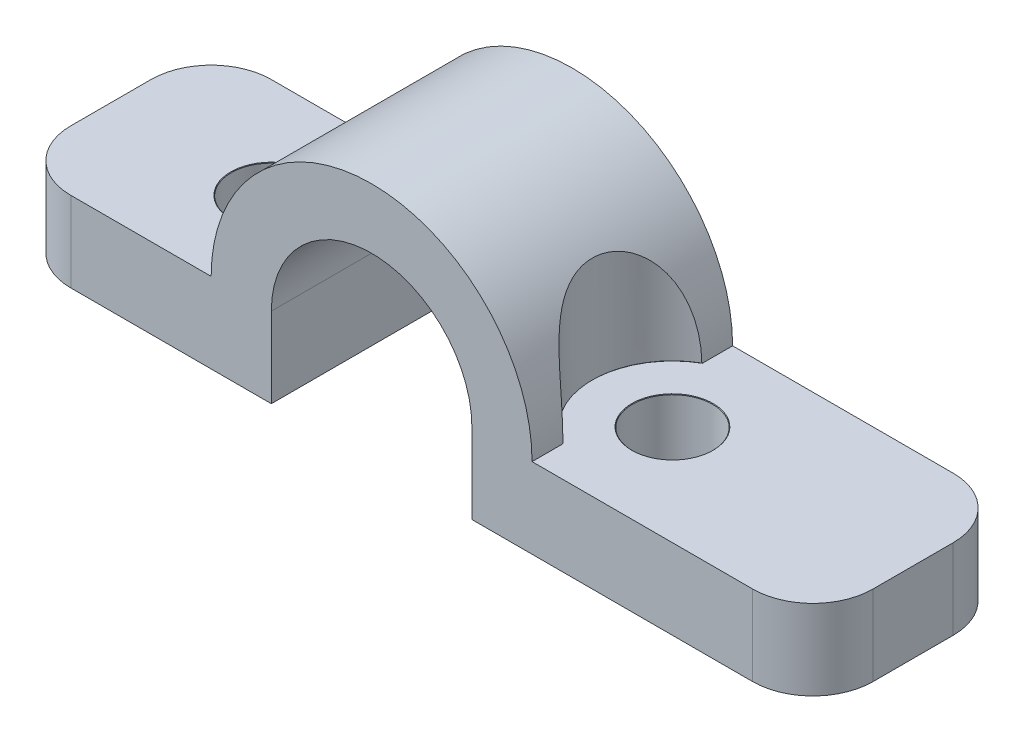
ISO-10303-21;
HEADER;
FILE_DESCRIPTION(('STEP AP214'),'2;1');
FILE_NAME('part.step','',(''),(''),'','','');
FILE_SCHEMA(('AUTOMOTIVE_DESIGN { 1 0 10303 214 1 1 1 1 }'));
ENDSEC;
DATA;
#1=APPLICATION_CONTEXT('core data for automotive mechanical design processes');
#2=APPLICATION_PROTOCOL_DEFINITION('international standard','automotive_design',2000,#1);
#3=PRODUCT_CONTEXT('',#1,'mechanical');
#4=PRODUCT('Part','Part','',(#3));
#5=PRODUCT_RELATED_PRODUCT_CATEGORY('part','',(#4));
#6=PRODUCT_DEFINITION_FORMATION('','',#4);
#7=PRODUCT_DEFINITION_CONTEXT('part definition',#1,'design');
#8=PRODUCT_DEFINITION('design','',#6,#7);
#9=PRODUCT_DEFINITION_SHAPE('','',#8);
#10=(LENGTH_UNIT() NAMED_UNIT(*) SI_UNIT(.MILLI.,.METRE.));
#11=(NAMED_UNIT(*) PLANE_ANGLE_UNIT() SI_UNIT($,.RADIAN.));
#12=(NAMED_UNIT(*) SI_UNIT($,.STERADIAN.) SOLID_ANGLE_UNIT());
#13=UNCERTAINTY_MEASURE_WITH_UNIT(LENGTH_MEASURE(1.E-05),#10,'distance_accuracy_value','');
#14=(GEOMETRIC_REPRESENTATION_CONTEXT(3) GLOBAL_UNCERTAINTY_ASSIGNED_CONTEXT((#13)) GLOBAL_UNIT_ASSIGNED_CONTEXT((#10,
#11,#12)) REPRESENTATION_CONTEXT('',''));
#15=CARTESIAN_POINT('',(0.,0.,0.));
#16=DIRECTION('',(0.,0.,1.));
#17=DIRECTION('',(1.,0.,0.));
#18=AXIS2_PLACEMENT_3D('',#15,#16,#17);
#19=CARTESIAN_POINT('',(-18.,0.,-5.));
#20=DIRECTION('',(-1.,0.,0.));
#21=DIRECTION('',(0.,0.,1.));
#22=AXIS2_PLACEMENT_3D('',#19,#20,#21);
#23=PLANE('',#22);
#24=DIRECTION('',(0.,0.,1.));
#25=VECTOR('',#24,1.);
#26=CARTESIAN_POINT('',(-18.,4.,-5.));
#27=LINE('',#26,#25);
#28=CARTESIAN_POINT('',(-18.,4.,-2.));
#29=VERTEX_POINT('',#28);
#30=CARTESIAN_POINT('',(-18.,4.,2.));
#31=VERTEX_POINT('',#30);
#32=EDGE_CURVE('E184',#29,#31,#27,.T.);
#33=ORIENTED_EDGE('',*,*,#32,.F.);
#34=DIRECTION('',(0.,-1.,0.));
#35=VECTOR('',#34,1.);
#36=CARTESIAN_POINT('',(-18.,0.,-2.));
#37=LINE('',#36,#35);
#38=CARTESIAN_POINT('',(-18.,0.,-2.));
#39=VERTEX_POINT('',#38);
#40=EDGE_CURVE('E233',#29,#39,#37,.T.);
#41=ORIENTED_EDGE('',*,*,#40,.T.);
#42=DIRECTION('',(0.,0.,1.));
#43=VECTOR('',#42,1.);
#44=CARTESIAN_POINT('',(-18.,0.,-5.));
#45=LINE('',#44,#43);
#46=CARTESIAN_POINT('',(-18.,0.,2.));
#47=VERTEX_POINT('',#46);
#48=EDGE_CURVE('E211',#39,#47,#45,.T.);
#49=ORIENTED_EDGE('',*,*,#48,.T.);
#50=DIRECTION('',(0.,-1.,0.));
#51=VECTOR('',#50,1.);
#52=CARTESIAN_POINT('',(-18.,4.,2.));
#53=LINE('',#52,#51);
#54=EDGE_CURVE('E231',#47,#31,#53,.F.);
#55=ORIENTED_EDGE('',*,*,#54,.T.);
#56=EDGE_LOOP('',(#33,#41,#49,#55));
#57=FACE_BOUND('',#56,.T.);
#58=ADVANCED_FACE('F33',(#57),#23,.T.);
#59=CARTESIAN_POINT('',(-18.,4.,-5.));
#60=DIRECTION('',(0.,1.,0.));
#61=DIRECTION('',(0.,0.,1.));
#62=AXIS2_PLACEMENT_3D('',#59,#60,#61);
#63=PLANE('',#62);
#64=DIRECTION('',(0.,0.,1.));
#65=VECTOR('',#64,1.);
#66=CARTESIAN_POINT('',(-8.,4.,-5.));
#67=LINE('',#66,#65);
#68=CARTESIAN_POINT('',(-8.,4.,3.49293930665851));
#69=VERTEX_POINT('',#68);
#70=CARTESIAN_POINT('',(-8.,4.,5.));
#71=VERTEX_POINT('',#70);
#72=EDGE_CURVE('E185',#69,#71,#67,.T.);
#73=ORIENTED_EDGE('',*,*,#72,.F.);
#74=CARTESIAN_POINT('',(-10.,4.,0.));
#75=DIRECTION('',(0.,-1.,0.));
#76=DIRECTION('',(0.,0.,-1.));
#77=AXIS2_PLACEMENT_3D('',#74,#75,#76);
#78=CIRCLE('',#77,4.025);
#79=CARTESIAN_POINT('',(-8.,4.,-3.49293930665851));
#80=VERTEX_POINT('',#79);
#81=EDGE_CURVE('E172',#80,#69,#78,.T.);
#82=ORIENTED_EDGE('',*,*,#81,.F.);
#83=CARTESIAN_POINT('',(-8.,4.,-5.));
#84=VERTEX_POINT('',#83);
#85=EDGE_CURVE('E177',#84,#80,#67,.T.);
#86=ORIENTED_EDGE('',*,*,#85,.F.);
#87=DIRECTION('',(-1.,0.,0.));
#88=VECTOR('',#87,1.);
#89=CARTESIAN_POINT('',(-18.,4.,-5.));
#90=LINE('',#89,#88);
#91=CARTESIAN_POINT('',(-15.,4.,-5.));
#92=VERTEX_POINT('',#91);
#93=EDGE_CURVE('E214',#84,#92,#90,.T.);
#94=ORIENTED_EDGE('',*,*,#93,.T.);
#95=CARTESIAN_POINT('',(-15.,4.,-2.));
#96=DIRECTION('',(0.,1.,0.));
#97=DIRECTION('',(0.,0.,1.));
#98=AXIS2_PLACEMENT_3D('',#95,#96,#97);
#99=CIRCLE('',#98,3.);
#100=EDGE_CURVE('E242',#92,#29,#99,.T.);
#101=ORIENTED_EDGE('',*,*,#100,.T.);
#102=ORIENTED_EDGE('',*,*,#32,.T.);
#103=CARTESIAN_POINT('',(-15.,4.,2.));
#104=DIRECTION('',(0.,1.,0.));
#105=DIRECTION('',(0.,0.,1.));
#106=AXIS2_PLACEMENT_3D('',#103,#104,#105);
#107=CIRCLE('',#106,3.);
#108=CARTESIAN_POINT('',(-15.,4.,5.));
#109=VERTEX_POINT('',#108);
#110=EDGE_CURVE('E240',#31,#109,#107,.T.);
#111=ORIENTED_EDGE('',*,*,#110,.T.);
#112=DIRECTION('',(-1.,0.,0.));
#113=VECTOR('',#112,1.);
#114=CARTESIAN_POINT('',(-18.,4.,5.));
#115=LINE('',#114,#113);
#116=EDGE_CURVE('E348',#71,#109,#115,.T.);
#117=ORIENTED_EDGE('',*,*,#116,.F.);
#118=EDGE_LOOP('',(#73,#82,#86,#94,#101,#102,#111,#117));
#119=FACE_BOUND('',#118,.T.);
#120=CARTESIAN_POINT('',(-10.,4.,0.));
#121=DIRECTION('',(0.,1.,0.));
#122=DIRECTION('',(0.,0.,1.));
#123=AXIS2_PLACEMENT_3D('',#120,#121,#122);
#124=CIRCLE('',#123,2.025);
#125=CARTESIAN_POINT('',(-10.,4.,2.025));
#126=VERTEX_POINT('',#125);
#127=EDGE_CURVE('E313',#126,#126,#124,.T.);
#128=ORIENTED_EDGE('',*,*,#127,.F.);
#129=EDGE_LOOP('',(#128));
#130=FACE_BOUND('',#129,.T.);
#131=ADVANCED_FACE('F299',(#119,#130),#63,.T.);
#132=CARTESIAN_POINT('',(0.,4.,-5.));
#133=DIRECTION('',(0.,0.,1.));
#134=DIRECTION('',(1.,0.,0.));
#135=AXIS2_PLACEMENT_3D('',#132,#133,#134);
#136=CYLINDRICAL_SURFACE('',#135,8.);
#137=CARTESIAN_POINT('',(-7.99995204423127,4.0277,-3.46095585996489));
#138=CARTESIAN_POINT('',(-7.99996957764709,4.02263972398067,-3.46681040292332));
#139=CARTESIAN_POINT('',(-7.9999823027003,4.01757625263604,-3.47266218446504));
#140=CARTESIAN_POINT('',(-7.99999813608153,4.0074429193027,-3.48436022470756));
#141=CARTESIAN_POINT('',(-8.00000124440955,4.002373057314,-3.49020648340836));
#142=CARTESIAN_POINT('',(-7.99999954437499,3.9973,-3.49604998069246));
#143=B_SPLINE_CURVE_WITH_KNOTS('',3,(#137,#138,#139,#140,#141,#142),.UNSPECIFIED.,.F.,.F.,(4,2,
4),(0.,0.0232150869214942,0.0464301738131203),.UNSPECIFIED.);
#144=CARTESIAN_POINT('',(-7.99996093740463,4.025,-3.46407906204414));
#145=VERTEX_POINT('',#144);
#146=EDGE_CURVE('E11',#145,#80,#143,.T.);
#147=ORIENTED_EDGE('',*,*,#146,.F.);
#148=CARTESIAN_POINT('',(-7.99996093740463,4.025,3.46407906204414));
#149=CARTESIAN_POINT('',(-7.99969797190053,4.10923273656466,3.46392402297538));
#150=CARTESIAN_POINT('',(-7.99810393301854,4.19345225549861,3.46300729437637));
#151=CARTESIAN_POINT('',(-7.99225973584734,4.36176818488701,3.45962345500483));
#152=CARTESIAN_POINT('',(-7.98800956621208,4.44586459481404,3.4571563376096));
#153=CARTESIAN_POINT('',(-7.97127865709272,4.69790239293734,3.44738583375854));
#154=CARTESIAN_POINT('',(-7.95481777597678,4.86551261003954,3.43771339036424));
#155=CARTESIAN_POINT('',(-7.91128390373772,5.20011545013118,3.41143872365164));
#156=CARTESIAN_POINT('',(-7.88412995309651,5.36709331132888,3.39478356902883));
#157=CARTESIAN_POINT('',(-7.81952958510747,5.6980456938918,3.35365763147336));
#158=CARTESIAN_POINT('',(-7.78208614910302,5.86202107055984,3.32918911210435));
#159=CARTESIAN_POINT('',(-7.70395012665325,6.16083146605703,3.27567250529183));
#160=CARTESIAN_POINT('',(-7.66464827765331,6.29626184661323,3.24791190075164));
#161=CARTESIAN_POINT('',(-7.57952197492005,6.56329300080081,3.18497885016741));
#162=CARTESIAN_POINT('',(-7.5336986945703,6.6948944582406,3.14980773693043));
#163=CARTESIAN_POINT('',(-7.43633574554271,6.95294309436941,3.07108018201846));
#164=CARTESIAN_POINT('',(-7.38481289479551,7.079404007192,3.02754814541693));
#165=CARTESIAN_POINT('',(-7.27688566168496,7.32642111165351,2.93085245385272));
#166=CARTESIAN_POINT('',(-7.22048292779599,7.44697927591751,2.87769204486857));
#167=CARTESIAN_POINT('',(-7.11952336573038,7.6498795922888,2.77606378824973));
#168=CARTESIAN_POINT('',(-7.0757885423064,7.73388238104164,2.73008597601526));
#169=CARTESIAN_POINT('',(-6.98705213019283,7.89740271542049,2.6318296444419));
#170=CARTESIAN_POINT('',(-6.94205087388019,7.97692142174296,2.57955276669662));
#171=CARTESIAN_POINT('',(-6.85160074328792,8.13080175272035,2.46834182019133));
#172=CARTESIAN_POINT('',(-6.806152243454,8.2051673313425,2.40941294883268));
#173=CARTESIAN_POINT('',(-6.71573154801604,8.34811617418772,2.28462693053741));
#174=CARTESIAN_POINT('',(-6.67075926790155,8.4167004799241,2.21877103635026));
#175=CARTESIAN_POINT('',(-6.55404453202282,8.58924509579359,2.03557558211148));
#176=CARTESIAN_POINT('',(-6.48355338788034,8.68781591827526,1.91222226721444));
#177=CARTESIAN_POINT('',(-6.35190083649897,8.86472902204808,1.64717148616044));
#178=CARTESIAN_POINT('',(-6.290737064551,8.94307643395181,1.50547868639329));
#179=CARTESIAN_POINT('',(-6.2098268338169,9.04380075002214,1.2810210709257));
#180=CARTESIAN_POINT('',(-6.18459162193383,9.07465643819709,1.20391619180751));
#181=CARTESIAN_POINT('',(-6.13841250644518,9.1304192232599,1.0463581026631));
#182=CARTESIAN_POINT('',(-6.11746667227406,9.15532899712796,0.965906418672271));
#183=CARTESIAN_POINT('',(-6.08038346675806,9.19901559754903,0.802272742830093));
#184=CARTESIAN_POINT('',(-6.0642459179524,9.21779265044659,0.719090851869098));
#185=CARTESIAN_POINT('',(-6.0371789036451,9.2490845004237,0.550755653708957));
#186=CARTESIAN_POINT('',(-6.02624887958688,9.26159996912495,0.465602558967991));
#187=CARTESIAN_POINT('',(-6.00347927501828,9.28760876407288,0.226678983541391));
#188=CARTESIAN_POINT('',(-5.99765005550933,9.29416999243719,0.0714733268267729));
#189=CARTESIAN_POINT('',(-6.00408234722193,9.28687057064538,-0.237952806926167));
#190=CARTESIAN_POINT('',(-6.01633770741371,9.27301686413483,-0.392173601025394));
#191=CARTESIAN_POINT('',(-6.05712826259199,9.22609845765382,-0.689533061463698));
#192=CARTESIAN_POINT('',(-6.08505165013523,9.19375490652794,-0.832870750999783));
#193=CARTESIAN_POINT('',(-6.15463321227106,9.11110387310646,-1.11071072804406));
#194=CARTESIAN_POINT('',(-6.19629159583091,9.06079611749855,-1.24521288108912));
#195=CARTESIAN_POINT('',(-6.29222324735269,8.94105389671474,-1.5075348793511));
#196=CARTESIAN_POINT('',(-6.34692487710921,8.87095042398395,-1.63489000659682));
#197=CARTESIAN_POINT('',(-6.46415637206808,8.71425678293628,-1.87501700311941));
#198=CARTESIAN_POINT('',(-6.52668955033236,8.62765962900182,-1.9877826591687));
#199=CARTESIAN_POINT('',(-6.6352982164937,8.46977661712481,-2.16469691543467));
#200=CARTESIAN_POINT('',(-6.68033571983273,8.40228989462644,-2.2329537712367));
#201=CARTESIAN_POINT('',(-6.77116619946717,8.26125996162167,-2.3623887499653));
#202=CARTESIAN_POINT('',(-6.81695938936908,8.18771501437556,-2.42356483083968));
#203=CARTESIAN_POINT('',(-6.90833458588499,8.03519841737819,-2.53910222629693));
#204=CARTESIAN_POINT('',(-6.95391629442826,7.95622071331698,-2.59345574086843));
#205=CARTESIAN_POINT('',(-7.04397631952828,7.79355363000803,-2.69565637061808));
#206=CARTESIAN_POINT('',(-7.08845432432109,7.70986294082304,-2.74350166414058));
#207=CARTESIAN_POINT('',(-7.19110206769607,7.5078533832993,-2.84908494666468));
#208=CARTESIAN_POINT('',(-7.24850891702842,7.38781375915425,-2.90428076931744));
#209=CARTESIAN_POINT('',(-7.35858572951996,7.1415649251134,-3.00474384165666));
#210=CARTESIAN_POINT('',(-7.41125400393055,7.01535354024541,-3.05000755991201));
#211=CARTESIAN_POINT('',(-7.51099117761329,6.75756590453358,-3.13193437153713));
#212=CARTESIAN_POINT('',(-7.55804267360964,6.62597459293233,-3.16857105899075));
#213=CARTESIAN_POINT('',(-7.64564872760647,6.35877893980923,-3.23419582922868));
#214=CARTESIAN_POINT('',(-7.68620198801016,6.22317380317753,-3.26318238514629));
#215=CARTESIAN_POINT('',(-7.76823931244062,5.9194299059439,-3.31997746675532));
#216=CARTESIAN_POINT('',(-7.80806187400318,5.75054458748658,-3.3462035170474));
#217=CARTESIAN_POINT('',(-7.87678428948145,5.40945554657865,-3.39022338203617));
#218=CARTESIAN_POINT('',(-7.90568035629818,5.23725069527958,-3.40801427366687));
#219=CARTESIAN_POINT('',(-7.95199034661905,4.89213467968135,-3.43604212606164));
#220=CARTESIAN_POINT('',(-7.96949661456746,4.71924092915406,-3.44633992109434));
#221=CARTESIAN_POINT('',(-7.9872814073239,4.4592229323598,-3.45673312373376));
#222=CARTESIAN_POINT('',(-7.9917971565954,4.37246200986037,-3.45935524850705));
#223=CARTESIAN_POINT('',(-7.99800126074643,4.1988055043459,-3.46294807240828));
#224=CARTESIAN_POINT('',(-7.99968963532629,4.11190992227335,-3.46391878304281));
#225=CARTESIAN_POINT('',(-7.99996093740463,4.025,-3.46407906204414));
#226=B_SPLINE_CURVE_WITH_KNOTS('',3,(#148,#149,#150,#151,#152,#153,#154,#155,#156,#157,#158,
#159,#160,#161,#162,#163,#164,#165,#166,#167,#168,#169,#170,#171,#172,#173,#174,#175,#176,#177,
#178,#179,#180,#181,#182,#183,#184,#185,#186,#187,#188,#189,#190,#191,#192,#193,#194,#195,#196,
#197,#198,#199,#200,#201,#202,#203,#204,#205,#206,#207,#208,#209,#210,#211,#212,#213,#214,#215,
#216,#217,#218,#219,#220,#221,#222,#223,#224,#225),.UNSPECIFIED.,.F.,.F.,(4,2,2,2,2,2,2,2,2,2,2,
2,2,2,2,2,2,2,2,2,2,2,2,2,2,2,2,2,2,2,2,2,2,2,2,2,2,2,4),(0.,0.252670358861786,
0.505341797047868,1.01092331525207,1.52040865840866,2.02974653528816,2.46056510148885,
2.89130624943759,3.32080868840061,3.75016659936097,4.06573781788458,4.38122697284042,
4.69647131096297,5.01165873497163,5.52819267741862,6.04459544782612,6.30467581107584,
6.56463885868272,6.82459231057009,7.08451787369639,7.54830912032308,8.01194265599734,
8.45861938583828,8.90530291183056,9.36939487294943,9.83368383116002,10.1513722692221,
10.4691520995996,10.7872919905257,11.1055207465999,11.5370421627116,11.9687167616378,
12.4016959521035,12.8347614943406,13.3605957467191,13.8866120853985,14.4083086944775,
14.6690095487375,14.9297085865),.UNSPECIFIED.);
#227=CARTESIAN_POINT('',(-7.99996093740463,4.025,3.46407906204414));
#228=VERTEX_POINT('',#227);
#229=EDGE_CURVE('E161',#228,#145,#226,.T.);
#230=ORIENTED_EDGE('',*,*,#229,.F.);
#231=CARTESIAN_POINT('',(-7.99999954437499,3.9973,3.49604998069246));
#232=CARTESIAN_POINT('',(-8.00000124440955,4.00237305731399,3.49020648340836));
#233=CARTESIAN_POINT('',(-7.99999813608153,4.0074429193027,3.48436022470756));
#234=CARTESIAN_POINT('',(-7.9999823027003,4.01757625263604,3.47266218446504));
#235=CARTESIAN_POINT('',(-7.99996957764709,4.02263972398067,3.46681040292332));
#236=CARTESIAN_POINT('',(-7.99995204423127,4.0277,3.46095585996489));
#237=B_SPLINE_CURVE_WITH_KNOTS('',3,(#231,#232,#233,#234,#235,#236),.UNSPECIFIED.,.F.,.F.,(4,2,
4),(0.,0.0232150868916257,0.0464301738131208),.UNSPECIFIED.);
#238=EDGE_CURVE('E47',#69,#228,#237,.T.);
#239=ORIENTED_EDGE('',*,*,#238,.F.);
#240=ORIENTED_EDGE('',*,*,#72,.T.);
#241=CARTESIAN_POINT('',(0.,4.,5.));
#242=DIRECTION('',(0.,0.,1.));
#243=DIRECTION('',(-1.,0.,0.));
#244=AXIS2_PLACEMENT_3D('',#241,#242,#243);
#245=CIRCLE('',#244,8.);
#246=CARTESIAN_POINT('',(8.,4.,5.));
#247=VERTEX_POINT('',#246);
#248=EDGE_CURVE('E345',#247,#71,#245,.T.);
#249=ORIENTED_EDGE('',*,*,#248,.F.);
#250=DIRECTION('',(0.,0.,1.));
#251=VECTOR('',#250,1.);
#252=CARTESIAN_POINT('',(8.,4.,-5.));
#253=LINE('',#252,#251);
#254=CARTESIAN_POINT('',(8.,4.,3.49293930665851));
#255=VERTEX_POINT('',#254);
#256=EDGE_CURVE('E195',#255,#247,#253,.T.);
#257=ORIENTED_EDGE('',*,*,#256,.F.);
#258=CARTESIAN_POINT('',(7.99995204423127,4.0277,3.46095585996489));
#259=CARTESIAN_POINT('',(7.99996957764709,4.02263972398067,3.46681040292332));
#260=CARTESIAN_POINT('',(7.9999823027003,4.01757625263604,3.47266218446504));
#261=CARTESIAN_POINT('',(7.99999813608153,4.0074429193027,3.48436022470756));
#262=CARTESIAN_POINT('',(8.00000124440955,4.002373057314,3.49020648340836));
#263=CARTESIAN_POINT('',(7.99999954437499,3.9973,3.49604998069246));
#264=B_SPLINE_CURVE_WITH_KNOTS('',3,(#258,#259,#260,#261,#262,#263),.UNSPECIFIED.,.F.,.F.,(4,2,
4),(0.,0.0232150869214949,0.046430173813121),.UNSPECIFIED.);
#265=CARTESIAN_POINT('',(7.99996093740463,4.025,3.46407906204414));
#266=VERTEX_POINT('',#265);
#267=EDGE_CURVE('E166',#266,#255,#264,.T.);
#268=ORIENTED_EDGE('',*,*,#267,.F.);
#269=CARTESIAN_POINT('',(7.99996093740463,4.025,-3.46407906204414));
#270=CARTESIAN_POINT('',(7.99969797190053,4.10923273656466,-3.46392402297538));
#271=CARTESIAN_POINT('',(7.99810393301854,4.19345225549861,-3.46300729437637));
#272=CARTESIAN_POINT('',(7.99225973584734,4.36176818488701,-3.45962345500483));
#273=CARTESIAN_POINT('',(7.98800956621208,4.44586459481404,-3.4571563376096));
#274=CARTESIAN_POINT('',(7.97127865709272,4.69790239293734,-3.44738583375854));
#275=CARTESIAN_POINT('',(7.95481777597678,4.86551261003954,-3.43771339036424));
#276=CARTESIAN_POINT('',(7.91128390373772,5.20011545013118,-3.41143872365164));
#277=CARTESIAN_POINT('',(7.88412995309651,5.36709331132888,-3.39478356902883));
#278=CARTESIAN_POINT('',(7.81952958510747,5.6980456938918,-3.35365763147336));
#279=CARTESIAN_POINT('',(7.78208614910302,5.86202107055984,-3.32918911210435));
#280=CARTESIAN_POINT('',(7.70395012665325,6.16083146605703,-3.27567250529183));
#281=CARTESIAN_POINT('',(7.66464827765331,6.29626184661323,-3.24791190075164));
#282=CARTESIAN_POINT('',(7.57952197492005,6.56329300080081,-3.18497885016741));
#283=CARTESIAN_POINT('',(7.5336986945703,6.6948944582406,-3.14980773693043));
#284=CARTESIAN_POINT('',(7.43633574554271,6.95294309436941,-3.07108018201846));
#285=CARTESIAN_POINT('',(7.38481289479551,7.079404007192,-3.02754814541693));
#286=CARTESIAN_POINT('',(7.27688566168496,7.32642111165351,-2.93085245385272));
#287=CARTESIAN_POINT('',(7.22048292779599,7.44697927591751,-2.87769204486857));
#288=CARTESIAN_POINT('',(7.11952336573038,7.6498795922888,-2.77606378824973));
#289=CARTESIAN_POINT('',(7.0757885423064,7.73388238104164,-2.73008597601526));
#290=CARTESIAN_POINT('',(6.98705213019283,7.89740271542049,-2.6318296444419));
#291=CARTESIAN_POINT('',(6.94205087388019,7.97692142174296,-2.57955276669662));
#292=CARTESIAN_POINT('',(6.85160074328792,8.13080175272035,-2.46834182019133));
#293=CARTESIAN_POINT('',(6.806152243454,8.2051673313425,-2.40941294883268));
#294=CARTESIAN_POINT('',(6.71573154801604,8.34811617418772,-2.28462693053741));
#295=CARTESIAN_POINT('',(6.67075926790155,8.4167004799241,-2.21877103635026));
#296=CARTESIAN_POINT('',(6.55404453202282,8.58924509579359,-2.03557558211148));
#297=CARTESIAN_POINT('',(6.48355338788034,8.68781591827526,-1.91222226721444));
#298=CARTESIAN_POINT('',(6.35190083649897,8.86472902204808,-1.64717148616044));
#299=CARTESIAN_POINT('',(6.290737064551,8.94307643395181,-1.50547868639329));
#300=CARTESIAN_POINT('',(6.2098268338169,9.04380075002214,-1.2810210709257));
#301=CARTESIAN_POINT('',(6.18459162193383,9.07465643819709,-1.20391619180751));
#302=CARTESIAN_POINT('',(6.13841250644518,9.1304192232599,-1.0463581026631));
#303=CARTESIAN_POINT('',(6.11746667227406,9.15532899712796,-0.965906418672271));
#304=CARTESIAN_POINT('',(6.08038346675806,9.19901559754903,-0.802272742830093));
#305=CARTESIAN_POINT('',(6.0642459179524,9.21779265044659,-0.719090851869098));
#306=CARTESIAN_POINT('',(6.0371789036451,9.2490845004237,-0.550755653708957));
#307=CARTESIAN_POINT('',(6.02624887958688,9.26159996912495,-0.465602558967991));
#308=CARTESIAN_POINT('',(6.00347927501828,9.28760876407288,-0.226678983541391));
#309=CARTESIAN_POINT('',(5.99765005550933,9.29416999243719,-0.0714733268267729));
#310=CARTESIAN_POINT('',(6.00408234722193,9.28687057064538,0.237952806926167));
#311=CARTESIAN_POINT('',(6.01633770741371,9.27301686413483,0.392173601025394));
#312=CARTESIAN_POINT('',(6.05712826259199,9.22609845765382,0.689533061463698));
#313=CARTESIAN_POINT('',(6.08505165013523,9.19375490652794,0.832870750999783));
#314=CARTESIAN_POINT('',(6.15463321227106,9.11110387310646,1.11071072804406));
#315=CARTESIAN_POINT('',(6.19629159583091,9.06079611749855,1.24521288108912));
#316=CARTESIAN_POINT('',(6.29222324735269,8.94105389671474,1.5075348793511));
#317=CARTESIAN_POINT('',(6.34692487710921,8.87095042398395,1.63489000659682));
#318=CARTESIAN_POINT('',(6.46415637206808,8.71425678293628,1.87501700311941));
#319=CARTESIAN_POINT('',(6.52668955033236,8.62765962900182,1.9877826591687));
#320=CARTESIAN_POINT('',(6.6352982164937,8.46977661712481,2.16469691543467));
#321=CARTESIAN_POINT('',(6.68033571983273,8.40228989462644,2.2329537712367));
#322=CARTESIAN_POINT('',(6.77116619946717,8.26125996162167,2.3623887499653));
#323=CARTESIAN_POINT('',(6.81695938936908,8.18771501437556,2.42356483083968));
#324=CARTESIAN_POINT('',(6.90833458588499,8.03519841737819,2.53910222629693));
#325=CARTESIAN_POINT('',(6.95391629442826,7.95622071331698,2.59345574086843));
#326=CARTESIAN_POINT('',(7.04397631952828,7.79355363000803,2.69565637061808));
#327=CARTESIAN_POINT('',(7.08845432432109,7.70986294082304,2.74350166414058));
#328=CARTESIAN_POINT('',(7.19110206769607,7.5078533832993,2.84908494666468));
#329=CARTESIAN_POINT('',(7.24850891702842,7.38781375915425,2.90428076931744));
#330=CARTESIAN_POINT('',(7.35858572951996,7.1415649251134,3.00474384165666));
#331=CARTESIAN_POINT('',(7.41125400393055,7.01535354024541,3.05000755991201));
#332=CARTESIAN_POINT('',(7.51099117761329,6.75756590453358,3.13193437153713));
#333=CARTESIAN_POINT('',(7.55804267360964,6.62597459293233,3.16857105899075));
#334=CARTESIAN_POINT('',(7.64564872760647,6.35877893980923,3.23419582922868));
#335=CARTESIAN_POINT('',(7.68620198801016,6.22317380317753,3.26318238514629));
#336=CARTESIAN_POINT('',(7.76823931244062,5.9194299059439,3.31997746675532));
#337=CARTESIAN_POINT('',(7.80806187400318,5.75054458748658,3.3462035170474));
#338=CARTESIAN_POINT('',(7.87678428948145,5.40945554657865,3.39022338203617));
#339=CARTESIAN_POINT('',(7.90568035629818,5.23725069527958,3.40801427366687));
#340=CARTESIAN_POINT('',(7.95199034661905,4.89213467968135,3.43604212606164));
#341=CARTESIAN_POINT('',(7.96949661456746,4.71924092915406,3.44633992109434));
#342=CARTESIAN_POINT('',(7.9872814073239,4.4592229323598,3.45673312373376));
#343=CARTESIAN_POINT('',(7.9917971565954,4.37246200986037,3.45935524850705));
#344=CARTESIAN_POINT('',(7.99800126074643,4.1988055043459,3.46294807240828));
#345=CARTESIAN_POINT('',(7.99968963532629,4.11190992227335,3.46391878304281));
#346=CARTESIAN_POINT('',(7.99996093740463,4.025,3.46407906204414));
#347=B_SPLINE_CURVE_WITH_KNOTS('',3,(#269,#270,#271,#272,#273,#274,#275,#276,#277,#278,#279,
#280,#281,#282,#283,#284,#285,#286,#287,#288,#289,#290,#291,#292,#293,#294,#295,#296,#297,#298,
#299,#300,#301,#302,#303,#304,#305,#306,#307,#308,#309,#310,#311,#312,#313,#314,#315,#316,#317,
#318,#319,#320,#321,#322,#323,#324,#325,#326,#327,#328,#329,#330,#331,#332,#333,#334,#335,#336,
#337,#338,#339,#340,#341,#342,#343,#344,#345,#346),.UNSPECIFIED.,.F.,.F.,(4,2,2,2,2,2,2,2,2,2,2,
2,2,2,2,2,2,2,2,2,2,2,2,2,2,2,2,2,2,2,2,2,2,2,2,2,2,2,4),(0.,0.252670358861786,
0.505341797047868,1.01092331525207,1.52040865840866,2.02974653528816,2.46056510148885,
2.89130624943759,3.32080868840061,3.75016659936097,4.06573781788458,4.38122697284042,
4.69647131096297,5.01165873497163,5.52819267741862,6.04459544782612,6.30467581107584,
6.56463885868272,6.82459231057009,7.08451787369639,7.54830912032308,8.01194265599734,
8.45861938583828,8.90530291183056,9.36939487294943,9.83368383116002,10.1513722692221,
10.4691520995996,10.7872919905257,11.1055207465999,11.5370421627116,11.9687167616378,
12.4016959521035,12.8347614943406,13.3605957467191,13.8866120853985,14.4083086944775,
14.6690095487375,14.9297085865),.UNSPECIFIED.);
#348=CARTESIAN_POINT('',(7.99996093740463,4.025,-3.46407906204414));
#349=VERTEX_POINT('',#348);
#350=EDGE_CURVE('E250',#349,#266,#347,.T.);
#351=ORIENTED_EDGE('',*,*,#350,.F.);
#352=CARTESIAN_POINT('',(7.99999954437499,3.9973,-3.49604998069246));
#353=CARTESIAN_POINT('',(8.00000124440955,4.00237305731399,-3.49020648340836));
#354=CARTESIAN_POINT('',(7.99999813608153,4.0074429193027,-3.48436022470756));
#355=CARTESIAN_POINT('',(7.9999823027003,4.01757625263604,-3.47266218446504));
#356=CARTESIAN_POINT('',(7.99996957764709,4.02263972398067,-3.46681040292332));
#357=CARTESIAN_POINT('',(7.99995204423127,4.0277,-3.46095585996489));
#358=B_SPLINE_CURVE_WITH_KNOTS('',3,(#352,#353,#354,#355,#356,#357),.UNSPECIFIED.,.F.,.F.,(4,2,
4),(0.,0.023215086891626,0.0464301738131209),.UNSPECIFIED.);
#359=CARTESIAN_POINT('',(8.,4.,-3.49293930665851));
#360=VERTEX_POINT('',#359);
#361=EDGE_CURVE('E257',#360,#349,#358,.T.);
#362=ORIENTED_EDGE('',*,*,#361,.F.);
#363=CARTESIAN_POINT('',(8.,4.,-5.));
#364=VERTEX_POINT('',#363);
#365=EDGE_CURVE('E190',#364,#360,#253,.T.);
#366=ORIENTED_EDGE('',*,*,#365,.F.);
#367=CARTESIAN_POINT('',(0.,4.,-5.));
#368=DIRECTION('',(0.,0.,1.));
#369=DIRECTION('',(-1.,0.,0.));
#370=AXIS2_PLACEMENT_3D('',#367,#368,#369);
#371=CIRCLE('',#370,8.);
#372=EDGE_CURVE('E180',#364,#84,#371,.T.);
#373=ORIENTED_EDGE('',*,*,#372,.T.);
#374=ORIENTED_EDGE('',*,*,#85,.T.);
#375=EDGE_LOOP('',(#147,#230,#239,#240,#249,#257,#268,#351,#362,#366,#373,#374));
#376=FACE_BOUND('',#375,.T.);
#377=ADVANCED_FACE('F175',(#376),#136,.T.);
#378=CARTESIAN_POINT('',(8.,4.,-5.));
#379=DIRECTION('',(0.,1.,0.));
#380=DIRECTION('',(0.,0.,1.));
#381=AXIS2_PLACEMENT_3D('',#378,#379,#380);
#382=PLANE('',#381);
#383=CARTESIAN_POINT('',(10.,4.,0.));
#384=DIRECTION('',(0.,1.,0.));
#385=DIRECTION('',(0.,0.,1.));
#386=AXIS2_PLACEMENT_3D('',#383,#384,#385);
#387=CIRCLE('',#386,2.025);
#388=CARTESIAN_POINT('',(10.,4.,2.025));
#389=VERTEX_POINT('',#388);
#390=EDGE_CURVE('E409',#389,#389,#387,.T.);
#391=ORIENTED_EDGE('',*,*,#390,.F.);
#392=EDGE_LOOP('',(#391));
#393=FACE_BOUND('',#392,.T.);
#394=ORIENTED_EDGE('',*,*,#365,.T.);
#395=CARTESIAN_POINT('',(10.,4.,0.));
#396=DIRECTION('',(0.,-1.,0.));
#397=DIRECTION('',(0.,0.,-1.));
#398=AXIS2_PLACEMENT_3D('',#395,#396,#397);
#399=CIRCLE('',#398,4.025);
#400=EDGE_CURVE('E171',#255,#360,#399,.T.);
#401=ORIENTED_EDGE('',*,*,#400,.F.);
#402=ORIENTED_EDGE('',*,*,#256,.T.);
#403=DIRECTION('',(-1.,0.,0.));
#404=VECTOR('',#403,1.);
#405=CARTESIAN_POINT('',(8.,4.,5.));
#406=LINE('',#405,#404);
#407=CARTESIAN_POINT('',(19.,4.,5.));
#408=VERTEX_POINT('',#407);
#409=EDGE_CURVE('E342',#408,#247,#406,.T.);
#410=ORIENTED_EDGE('',*,*,#409,.F.);
#411=CARTESIAN_POINT('',(19.,4.,2.));
#412=DIRECTION('',(0.,1.,0.));
#413=DIRECTION('',(0.,0.,1.));
#414=AXIS2_PLACEMENT_3D('',#411,#412,#413);
#415=CIRCLE('',#414,3.);
#416=CARTESIAN_POINT('',(22.,4.,2.));
#417=VERTEX_POINT('',#416);
#418=EDGE_CURVE('E219',#408,#417,#415,.T.);
#419=ORIENTED_EDGE('',*,*,#418,.T.);
#420=DIRECTION('',(0.,0.,1.));
#421=VECTOR('',#420,1.);
#422=CARTESIAN_POINT('',(22.,4.,-5.));
#423=LINE('',#422,#421);
#424=CARTESIAN_POINT('',(22.,4.,-2.));
#425=VERTEX_POINT('',#424);
#426=EDGE_CURVE('E196',#425,#417,#423,.T.);
#427=ORIENTED_EDGE('',*,*,#426,.F.);
#428=CARTESIAN_POINT('',(19.,4.,-2.));
#429=DIRECTION('',(0.,1.,0.));
#430=DIRECTION('',(0.,0.,1.));
#431=AXIS2_PLACEMENT_3D('',#428,#429,#430);
#432=CIRCLE('',#431,3.);
#433=CARTESIAN_POINT('',(19.,4.,-5.));
#434=VERTEX_POINT('',#433);
#435=EDGE_CURVE('E221',#425,#434,#432,.T.);
#436=ORIENTED_EDGE('',*,*,#435,.T.);
#437=DIRECTION('',(-1.,0.,0.));
#438=VECTOR('',#437,1.);
#439=CARTESIAN_POINT('',(8.,4.,-5.));
#440=LINE('',#439,#438);
#441=EDGE_CURVE('E365',#434,#364,#440,.T.);
#442=ORIENTED_EDGE('',*,*,#441,.T.);
#443=EDGE_LOOP('',(#394,#401,#402,#410,#419,#427,#436,#442));
#444=FACE_BOUND('',#443,.T.);
#445=ADVANCED_FACE('F305',(#393,#444),#382,.T.);
#446=CARTESIAN_POINT('',(22.,4.,-5.));
#447=DIRECTION('',(1.,0.,0.));
#448=DIRECTION('',(0.,0.,-1.));
#449=AXIS2_PLACEMENT_3D('',#446,#447,#448);
#450=PLANE('',#449);
#451=DIRECTION('',(0.,0.,1.));
#452=VECTOR('',#451,1.);
#453=CARTESIAN_POINT('',(22.,0.,-5.));
#454=LINE('',#453,#452);
#455=CARTESIAN_POINT('',(22.,0.,-2.));
#456=VERTEX_POINT('',#455);
#457=CARTESIAN_POINT('',(22.,0.,2.));
#458=VERTEX_POINT('',#457);
#459=EDGE_CURVE('E199',#456,#458,#454,.T.);
#460=ORIENTED_EDGE('',*,*,#459,.F.);
#461=DIRECTION('',(0.,1.,0.));
#462=VECTOR('',#461,1.);
#463=CARTESIAN_POINT('',(22.,4.,-2.));
#464=LINE('',#463,#462);
#465=EDGE_CURVE('E216',#456,#425,#464,.T.);
#466=ORIENTED_EDGE('',*,*,#465,.T.);
#467=ORIENTED_EDGE('',*,*,#426,.T.);
#468=DIRECTION('',(0.,1.,0.));
#469=VECTOR('',#468,1.);
#470=CARTESIAN_POINT('',(22.,0.,2.));
#471=LINE('',#470,#469);
#472=EDGE_CURVE('E188',#417,#458,#471,.F.);
#473=ORIENTED_EDGE('',*,*,#472,.T.);
#474=EDGE_LOOP('',(#460,#466,#467,#473));
#475=FACE_BOUND('',#474,.T.);
#476=ADVANCED_FACE('F421',(#475),#450,.T.);
#477=CARTESIAN_POINT('',(22.,0.,-5.));
#478=DIRECTION('',(0.,-1.,0.));
#479=DIRECTION('',(1.,0.,0.));
#480=AXIS2_PLACEMENT_3D('',#477,#478,#479);
#481=PLANE('',#480);
#482=CARTESIAN_POINT('',(10.,0.,0.));
#483=DIRECTION('',(0.,1.,0.));
#484=DIRECTION('',(0.,0.,1.));
#485=AXIS2_PLACEMENT_3D('',#482,#483,#484);
#486=CIRCLE('',#485,2.);
#487=CARTESIAN_POINT('',(10.,0.,2.));
#488=VERTEX_POINT('',#487);
#489=EDGE_CURVE('E316',#488,#488,#486,.T.);
#490=ORIENTED_EDGE('',*,*,#489,.T.);
#491=EDGE_LOOP('',(#490));
#492=FACE_BOUND('',#491,.T.);
#493=DIRECTION('',(1.,0.,0.));
#494=VECTOR('',#493,1.);
#495=CARTESIAN_POINT('',(22.,0.,-5.));
#496=LINE('',#495,#494);
#497=CARTESIAN_POINT('',(5.,0.,-5.));
#498=VERTEX_POINT('',#497);
#499=CARTESIAN_POINT('',(19.,0.,-5.));
#500=VERTEX_POINT('',#499);
#501=EDGE_CURVE('E362',#498,#500,#496,.T.);
#502=ORIENTED_EDGE('',*,*,#501,.T.);
#503=CARTESIAN_POINT('',(19.,0.,-2.));
#504=DIRECTION('',(0.,-1.,0.));
#505=DIRECTION('',(1.,0.,0.));
#506=AXIS2_PLACEMENT_3D('',#503,#504,#505);
#507=CIRCLE('',#506,3.);
#508=EDGE_CURVE('E229',#500,#456,#507,.T.);
#509=ORIENTED_EDGE('',*,*,#508,.T.);
#510=ORIENTED_EDGE('',*,*,#459,.T.);
#511=CARTESIAN_POINT('',(19.,0.,2.));
#512=DIRECTION('',(0.,-1.,0.));
#513=DIRECTION('',(1.,0.,0.));
#514=AXIS2_PLACEMENT_3D('',#511,#512,#513);
#515=CIRCLE('',#514,3.);
#516=CARTESIAN_POINT('',(19.,0.,5.));
#517=VERTEX_POINT('',#516);
#518=EDGE_CURVE('E227',#458,#517,#515,.T.);
#519=ORIENTED_EDGE('',*,*,#518,.T.);
#520=DIRECTION('',(1.,0.,0.));
#521=VECTOR('',#520,1.);
#522=CARTESIAN_POINT('',(22.,0.,5.));
#523=LINE('',#522,#521);
#524=CARTESIAN_POINT('',(5.,0.,5.));
#525=VERTEX_POINT('',#524);
#526=EDGE_CURVE('E339',#525,#517,#523,.T.);
#527=ORIENTED_EDGE('',*,*,#526,.F.);
#528=DIRECTION('',(0.,0.,1.));
#529=VECTOR('',#528,1.);
#530=CARTESIAN_POINT('',(5.,0.,-5.));
#531=LINE('',#530,#529);
#532=EDGE_CURVE('E202',#498,#525,#531,.T.);
#533=ORIENTED_EDGE('',*,*,#532,.F.);
#534=EDGE_LOOP('',(#502,#509,#510,#519,#527,#533));
#535=FACE_BOUND('',#534,.T.);
#536=ADVANCED_FACE('F425',(#492,#535),#481,.T.);
#537=CARTESIAN_POINT('',(5.,0.,-5.));
#538=DIRECTION('',(-1.,0.,0.));
#539=DIRECTION('',(0.,-1.,0.));
#540=AXIS2_PLACEMENT_3D('',#537,#538,#539);
#541=PLANE('',#540);
#542=ORIENTED_EDGE('',*,*,#532,.T.);
#543=DIRECTION('',(0.,-1.,0.));
#544=VECTOR('',#543,1.);
#545=CARTESIAN_POINT('',(5.,0.,5.));
#546=LINE('',#545,#544);
#547=CARTESIAN_POINT('',(5.,4.,5.));
#548=VERTEX_POINT('',#547);
#549=EDGE_CURVE('E336',#548,#525,#546,.T.);
#550=ORIENTED_EDGE('',*,*,#549,.F.);
#551=DIRECTION('',(0.,0.,1.));
#552=VECTOR('',#551,1.);
#553=CARTESIAN_POINT('',(5.,4.,-5.));
#554=LINE('',#553,#552);
#555=CARTESIAN_POINT('',(5.,4.,-5.));
#556=VERTEX_POINT('',#555);
#557=EDGE_CURVE('E204',#556,#548,#554,.T.);
#558=ORIENTED_EDGE('',*,*,#557,.F.);
#559=DIRECTION('',(0.,-1.,0.));
#560=VECTOR('',#559,1.);
#561=CARTESIAN_POINT('',(5.,0.,-5.));
#562=LINE('',#561,#560);
#563=EDGE_CURVE('E359',#556,#498,#562,.T.);
#564=ORIENTED_EDGE('',*,*,#563,.T.);
#565=EDGE_LOOP('',(#542,#550,#558,#564));
#566=FACE_BOUND('',#565,.T.);
#567=ADVANCED_FACE('F431',(#566),#541,.T.);
#568=CARTESIAN_POINT('',(0.,4.,-5.));
#569=DIRECTION('',(0.,0.,1.));
#570=DIRECTION('',(1.,0.,0.));
#571=AXIS2_PLACEMENT_3D('',#568,#569,#570);
#572=CYLINDRICAL_SURFACE('',#571,5.);
#573=ORIENTED_EDGE('',*,*,#557,.T.);
#574=CARTESIAN_POINT('',(0.,4.,5.));
#575=DIRECTION('',(0.,0.,-1.));
#576=DIRECTION('',(-1.,0.,0.));
#577=AXIS2_PLACEMENT_3D('',#574,#575,#576);
#578=CIRCLE('',#577,5.);
#579=CARTESIAN_POINT('',(-5.,4.,5.));
#580=VERTEX_POINT('',#579);
#581=EDGE_CURVE('E333',#580,#548,#578,.T.);
#582=ORIENTED_EDGE('',*,*,#581,.F.);
#583=DIRECTION('',(0.,0.,1.));
#584=VECTOR('',#583,1.);
#585=CARTESIAN_POINT('',(-5.,4.,-5.));
#586=LINE('',#585,#584);
#587=CARTESIAN_POINT('',(-5.,4.,-5.));
#588=VERTEX_POINT('',#587);
#589=EDGE_CURVE('E206',#588,#580,#586,.T.);
#590=ORIENTED_EDGE('',*,*,#589,.F.);
#591=CARTESIAN_POINT('',(0.,4.,-5.));
#592=DIRECTION('',(0.,0.,-1.));
#593=DIRECTION('',(-1.,0.,0.));
#594=AXIS2_PLACEMENT_3D('',#591,#592,#593);
#595=CIRCLE('',#594,5.);
#596=EDGE_CURVE('E356',#588,#556,#595,.T.);
#597=ORIENTED_EDGE('',*,*,#596,.T.);
#598=EDGE_LOOP('',(#573,#582,#590,#597));
#599=FACE_BOUND('',#598,.T.);
#600=ADVANCED_FACE('F435',(#599),#572,.F.);
#601=CARTESIAN_POINT('',(-5.,0.,-5.));
#602=DIRECTION('',(1.,0.,0.));
#603=DIRECTION('',(0.,1.,0.));
#604=AXIS2_PLACEMENT_3D('',#601,#602,#603);
#605=PLANE('',#604);
#606=ORIENTED_EDGE('',*,*,#589,.T.);
#607=DIRECTION('',(0.,1.,0.));
#608=VECTOR('',#607,1.);
#609=CARTESIAN_POINT('',(-5.,0.,5.));
#610=LINE('',#609,#608);
#611=CARTESIAN_POINT('',(-5.,0.,5.));
#612=VERTEX_POINT('',#611);
#613=EDGE_CURVE('E330',#612,#580,#610,.T.);
#614=ORIENTED_EDGE('',*,*,#613,.F.);
#615=DIRECTION('',(0.,0.,1.));
#616=VECTOR('',#615,1.);
#617=CARTESIAN_POINT('',(-5.,0.,-5.));
#618=LINE('',#617,#616);
#619=CARTESIAN_POINT('',(-5.,0.,-5.));
#620=VERTEX_POINT('',#619);
#621=EDGE_CURVE('E208',#620,#612,#618,.T.);
#622=ORIENTED_EDGE('',*,*,#621,.F.);
#623=DIRECTION('',(0.,1.,0.));
#624=VECTOR('',#623,1.);
#625=CARTESIAN_POINT('',(-5.,0.,-5.));
#626=LINE('',#625,#624);
#627=EDGE_CURVE('E353',#620,#588,#626,.T.);
#628=ORIENTED_EDGE('',*,*,#627,.T.);
#629=EDGE_LOOP('',(#606,#614,#622,#628));
#630=FACE_BOUND('',#629,.T.);
#631=ADVANCED_FACE('F439',(#630),#605,.T.);
#632=CARTESIAN_POINT('',(-18.,0.,-5.));
#633=DIRECTION('',(0.,-1.,0.));
#634=DIRECTION('',(0.,0.,-1.));
#635=AXIS2_PLACEMENT_3D('',#632,#633,#634);
#636=PLANE('',#635);
#637=CARTESIAN_POINT('',(-10.,0.,0.));
#638=DIRECTION('',(0.,1.,0.));
#639=DIRECTION('',(0.,0.,1.));
#640=AXIS2_PLACEMENT_3D('',#637,#638,#639);
#641=CIRCLE('',#640,2.);
#642=CARTESIAN_POINT('',(-10.,0.,2.));
#643=VERTEX_POINT('',#642);
#644=EDGE_CURVE('E319',#643,#643,#641,.T.);
#645=ORIENTED_EDGE('',*,*,#644,.T.);
#646=EDGE_LOOP('',(#645));
#647=FACE_BOUND('',#646,.T.);
#648=ORIENTED_EDGE('',*,*,#48,.F.);
#649=CARTESIAN_POINT('',(-15.,0.,-2.));
#650=DIRECTION('',(0.,-1.,0.));
#651=DIRECTION('',(0.,0.,-1.));
#652=AXIS2_PLACEMENT_3D('',#649,#650,#651);
#653=CIRCLE('',#652,3.);
#654=CARTESIAN_POINT('',(-15.,0.,-5.));
#655=VERTEX_POINT('',#654);
#656=EDGE_CURVE('E238',#39,#655,#653,.T.);
#657=ORIENTED_EDGE('',*,*,#656,.T.);
#658=DIRECTION('',(1.,0.,0.));
#659=VECTOR('',#658,1.);
#660=CARTESIAN_POINT('',(-18.,0.,-5.));
#661=LINE('',#660,#659);
#662=EDGE_CURVE('E351',#655,#620,#661,.T.);
#663=ORIENTED_EDGE('',*,*,#662,.T.);
#664=ORIENTED_EDGE('',*,*,#621,.T.);
#665=DIRECTION('',(1.,0.,0.));
#666=VECTOR('',#665,1.);
#667=CARTESIAN_POINT('',(-18.,0.,5.));
#668=LINE('',#667,#666);
#669=CARTESIAN_POINT('',(-15.,0.,5.));
#670=VERTEX_POINT('',#669);
#671=EDGE_CURVE('E328',#670,#612,#668,.T.);
#672=ORIENTED_EDGE('',*,*,#671,.F.);
#673=CARTESIAN_POINT('',(-15.,0.,2.));
#674=DIRECTION('',(0.,-1.,0.));
#675=DIRECTION('',(0.,0.,-1.));
#676=AXIS2_PLACEMENT_3D('',#673,#674,#675);
#677=CIRCLE('',#676,3.);
#678=EDGE_CURVE('E236',#670,#47,#677,.T.);
#679=ORIENTED_EDGE('',*,*,#678,.T.);
#680=EDGE_LOOP('',(#648,#657,#663,#664,#672,#679));
#681=FACE_BOUND('',#680,.T.);
#682=ADVANCED_FACE('F297',(#647,#681),#636,.T.);
#683=CARTESIAN_POINT('',(0.,4.,-5.));
#684=DIRECTION('',(0.,0.,-1.));
#685=DIRECTION('',(-1.,0.,0.));
#686=AXIS2_PLACEMENT_3D('',#683,#684,#685);
#687=PLANE('',#686);
#688=ORIENTED_EDGE('',*,*,#441,.F.);
#689=DIRECTION('',(0.,1.,0.));
#690=VECTOR('',#689,1.);
#691=CARTESIAN_POINT('',(19.,4.,-5.));
#692=LINE('',#691,#690);
#693=EDGE_CURVE('E225',#434,#500,#692,.F.);
#694=ORIENTED_EDGE('',*,*,#693,.T.);
#695=ORIENTED_EDGE('',*,*,#501,.F.);
#696=ORIENTED_EDGE('',*,*,#563,.F.);
#697=ORIENTED_EDGE('',*,*,#596,.F.);
#698=ORIENTED_EDGE('',*,*,#627,.F.);
#699=ORIENTED_EDGE('',*,*,#662,.F.);
#700=DIRECTION('',(0.,-1.,0.));
#701=VECTOR('',#700,1.);
#702=CARTESIAN_POINT('',(-15.,4.,-5.));
#703=LINE('',#702,#701);
#704=EDGE_CURVE('E223',#655,#92,#703,.F.);
#705=ORIENTED_EDGE('',*,*,#704,.T.);
#706=ORIENTED_EDGE('',*,*,#93,.F.);
#707=ORIENTED_EDGE('',*,*,#372,.F.);
#708=EDGE_LOOP('',(#688,#694,#695,#696,#697,#698,#699,#705,#706,#707));
#709=FACE_BOUND('',#708,.T.);
#710=ADVANCED_FACE('F294',(#709),#687,.T.);
#711=CARTESIAN_POINT('',(0.,4.,5.));
#712=DIRECTION('',(0.,0.,-1.));
#713=DIRECTION('',(-1.,0.,0.));
#714=AXIS2_PLACEMENT_3D('',#711,#712,#713);
#715=PLANE('',#714);
#716=ORIENTED_EDGE('',*,*,#526,.T.);
#717=DIRECTION('',(0.,1.,0.));
#718=VECTOR('',#717,1.);
#719=CARTESIAN_POINT('',(19.,4.,5.));
#720=LINE('',#719,#718);
#721=EDGE_CURVE('E247',#517,#408,#720,.T.);
#722=ORIENTED_EDGE('',*,*,#721,.T.);
#723=ORIENTED_EDGE('',*,*,#409,.T.);
#724=ORIENTED_EDGE('',*,*,#248,.T.);
#725=ORIENTED_EDGE('',*,*,#116,.T.);
#726=DIRECTION('',(0.,-1.,0.));
#727=VECTOR('',#726,1.);
#728=CARTESIAN_POINT('',(-15.,0.,5.));
#729=LINE('',#728,#727);
#730=EDGE_CURVE('E244',#109,#670,#729,.T.);
#731=ORIENTED_EDGE('',*,*,#730,.T.);
#732=ORIENTED_EDGE('',*,*,#671,.T.);
#733=ORIENTED_EDGE('',*,*,#613,.T.);
#734=ORIENTED_EDGE('',*,*,#581,.T.);
#735=ORIENTED_EDGE('',*,*,#549,.T.);
#736=EDGE_LOOP('',(#716,#722,#723,#724,#725,#731,#732,#733,#734,#735));
#737=FACE_BOUND('',#736,.T.);
#738=ADVANCED_FACE('F290',(#737),#715,.F.);
#739=CARTESIAN_POINT('',(-10.,4.,0.));
#740=DIRECTION('',(0.,1.,0.));
#741=DIRECTION('',(0.,0.,1.));
#742=AXIS2_PLACEMENT_3D('',#739,#740,#741);
#743=CYLINDRICAL_SURFACE('',#742,1.99999999999999);
#744=ORIENTED_EDGE('',*,*,#644,.F.);
#745=EDGE_LOOP('',(#744));
#746=FACE_BOUND('',#745,.T.);
#747=CARTESIAN_POINT('',(-10.,3.975,0.));
#748=DIRECTION('',(0.,1.,0.));
#749=DIRECTION('',(0.,0.,1.));
#750=AXIS2_PLACEMENT_3D('',#747,#748,#749);
#751=CIRCLE('',#750,1.99999999999999);
#752=CARTESIAN_POINT('',(-10.,3.975,1.99999999999999));
#753=VERTEX_POINT('',#752);
#754=EDGE_CURVE('E315',#753,#753,#751,.T.);
#755=ORIENTED_EDGE('',*,*,#754,.T.);
#756=EDGE_LOOP('',(#755));
#757=FACE_BOUND('',#756,.T.);
#758=ADVANCED_FACE('F286',(#746,#757),#743,.F.);
#759=CARTESIAN_POINT('',(-10.,4.,0.));
#760=DIRECTION('',(0.,1.,0.));
#761=DIRECTION('',(0.,0.,1.));
#762=AXIS2_PLACEMENT_3D('',#759,#760,#761);
#763=CONICAL_SURFACE('',#762,2.025,0.785398163397691);
#764=ORIENTED_EDGE('',*,*,#754,.F.);
#765=EDGE_LOOP('',(#764));
#766=FACE_BOUND('',#765,.T.);
#767=ORIENTED_EDGE('',*,*,#127,.T.);
#768=EDGE_LOOP('',(#767));
#769=FACE_BOUND('',#768,.T.);
#770=ADVANCED_FACE('F282',(#766,#769),#763,.F.);
#771=CARTESIAN_POINT('',(10.,4.,0.));
#772=DIRECTION('',(0.,1.,0.));
#773=DIRECTION('',(0.,0.,1.));
#774=AXIS2_PLACEMENT_3D('',#771,#772,#773);
#775=CYLINDRICAL_SURFACE('',#774,1.99999999999999);
#776=ORIENTED_EDGE('',*,*,#489,.F.);
#777=EDGE_LOOP('',(#776));
#778=FACE_BOUND('',#777,.T.);
#779=CARTESIAN_POINT('',(10.,3.975,0.));
#780=DIRECTION('',(0.,1.,0.));
#781=DIRECTION('',(0.,0.,1.));
#782=AXIS2_PLACEMENT_3D('',#779,#780,#781);
#783=CIRCLE('',#782,1.99999999999999);
#784=CARTESIAN_POINT('',(10.,3.975,1.99999999999999));
#785=VERTEX_POINT('',#784);
#786=EDGE_CURVE('E322',#785,#785,#783,.T.);
#787=ORIENTED_EDGE('',*,*,#786,.T.);
#788=EDGE_LOOP('',(#787));
#789=FACE_BOUND('',#788,.T.);
#790=ADVANCED_FACE('F278',(#778,#789),#775,.F.);
#791=CARTESIAN_POINT('',(10.,4.,0.));
#792=DIRECTION('',(0.,1.,0.));
#793=DIRECTION('',(0.,0.,1.));
#794=AXIS2_PLACEMENT_3D('',#791,#792,#793);
#795=CONICAL_SURFACE('',#794,2.025,0.785398163397691);
#796=ORIENTED_EDGE('',*,*,#786,.F.);
#797=EDGE_LOOP('',(#796));
#798=FACE_BOUND('',#797,.T.);
#799=ORIENTED_EDGE('',*,*,#390,.T.);
#800=EDGE_LOOP('',(#799));
#801=FACE_BOUND('',#800,.T.);
#802=ADVANCED_FACE('F274',(#798,#801),#795,.F.);
#803=CARTESIAN_POINT('',(19.,4.,-2.));
#804=DIRECTION('',(0.,1.,0.));
#805=DIRECTION('',(0.,0.,1.));
#806=AXIS2_PLACEMENT_3D('',#803,#804,#805);
#807=CYLINDRICAL_SURFACE('',#806,3.);
#808=ORIENTED_EDGE('',*,*,#508,.F.);
#809=ORIENTED_EDGE('',*,*,#693,.F.);
#810=ORIENTED_EDGE('',*,*,#435,.F.);
#811=ORIENTED_EDGE('',*,*,#465,.F.);
#812=EDGE_LOOP('',(#808,#809,#810,#811));
#813=FACE_BOUND('',#812,.T.);
#814=ADVANCED_FACE('F277',(#813),#807,.T.);
#815=CARTESIAN_POINT('',(-15.,0.,-2.));
#816=DIRECTION('',(0.,-1.,0.));
#817=DIRECTION('',(0.,0.,-1.));
#818=AXIS2_PLACEMENT_3D('',#815,#816,#817);
#819=CYLINDRICAL_SURFACE('',#818,3.);
#820=ORIENTED_EDGE('',*,*,#100,.F.);
#821=ORIENTED_EDGE('',*,*,#704,.F.);
#822=ORIENTED_EDGE('',*,*,#656,.F.);
#823=ORIENTED_EDGE('',*,*,#40,.F.);
#824=EDGE_LOOP('',(#820,#821,#822,#823));
#825=FACE_BOUND('',#824,.T.);
#826=ADVANCED_FACE('F372',(#825),#819,.T.);
#827=CARTESIAN_POINT('',(19.,4.,2.));
#828=DIRECTION('',(0.,-1.,0.));
#829=DIRECTION('',(0.,0.,-1.));
#830=AXIS2_PLACEMENT_3D('',#827,#828,#829);
#831=CYLINDRICAL_SURFACE('',#830,3.);
#832=ORIENTED_EDGE('',*,*,#518,.F.);
#833=ORIENTED_EDGE('',*,*,#472,.F.);
#834=ORIENTED_EDGE('',*,*,#418,.F.);
#835=ORIENTED_EDGE('',*,*,#721,.F.);
#836=EDGE_LOOP('',(#832,#833,#834,#835));
#837=FACE_BOUND('',#836,.T.);
#838=ADVANCED_FACE('F451',(#837),#831,.T.);
#839=CARTESIAN_POINT('',(-15.,4.,2.));
#840=DIRECTION('',(0.,1.,0.));
#841=DIRECTION('',(0.,0.,1.));
#842=AXIS2_PLACEMENT_3D('',#839,#840,#841);
#843=CYLINDRICAL_SURFACE('',#842,3.);
#844=ORIENTED_EDGE('',*,*,#110,.F.);
#845=ORIENTED_EDGE('',*,*,#54,.F.);
#846=ORIENTED_EDGE('',*,*,#678,.F.);
#847=ORIENTED_EDGE('',*,*,#730,.F.);
#848=EDGE_LOOP('',(#844,#845,#846,#847));
#849=FACE_BOUND('',#848,.T.);
#850=ADVANCED_FACE('F35',(#849),#843,.T.);
#851=CARTESIAN_POINT('',(10.,4.,0.));
#852=DIRECTION('',(0.,-1.,0.));
#853=DIRECTION('',(0.,0.,-1.));
#854=AXIS2_PLACEMENT_3D('',#851,#852,#853);
#855=CYLINDRICAL_SURFACE('',#854,4.);
#856=ORIENTED_EDGE('',*,*,#350,.T.);
#857=CARTESIAN_POINT('',(10.,4.025,0.));
#858=DIRECTION('',(0.,-1.,0.));
#859=DIRECTION('',(0.,0.,-1.));
#860=AXIS2_PLACEMENT_3D('',#857,#858,#859);
#861=CIRCLE('',#860,4.);
#862=EDGE_CURVE('E60',#266,#349,#861,.T.);
#863=ORIENTED_EDGE('',*,*,#862,.T.);
#864=EDGE_LOOP('',(#856,#863));
#865=FACE_BOUND('',#864,.T.);
#866=ADVANCED_FACE('F267',(#865),#855,.F.);
#867=CARTESIAN_POINT('',(10.,4.,0.));
#868=DIRECTION('',(0.,-1.,0.));
#869=DIRECTION('',(0.,0.,-1.));
#870=AXIS2_PLACEMENT_3D('',#867,#868,#869);
#871=CONICAL_SURFACE('',#870,4.025,0.785398163397448);
#872=ORIENTED_EDGE('',*,*,#267,.T.);
#873=ORIENTED_EDGE('',*,*,#400,.T.);
#874=ORIENTED_EDGE('',*,*,#361,.T.);
#875=ORIENTED_EDGE('',*,*,#862,.F.);
#876=EDGE_LOOP('',(#872,#873,#874,#875));
#877=FACE_BOUND('',#876,.T.);
#878=ADVANCED_FACE('F271',(#877),#871,.F.);
#879=CARTESIAN_POINT('',(-10.,4.,0.));
#880=DIRECTION('',(0.,-1.,0.));
#881=DIRECTION('',(0.,0.,-1.));
#882=AXIS2_PLACEMENT_3D('',#879,#880,#881);
#883=CYLINDRICAL_SURFACE('',#882,4.);
#884=ORIENTED_EDGE('',*,*,#229,.T.);
#885=CARTESIAN_POINT('',(-10.,4.025,0.));
#886=DIRECTION('',(0.,-1.,0.));
#887=DIRECTION('',(0.,0.,-1.));
#888=AXIS2_PLACEMENT_3D('',#885,#886,#887);
#889=CIRCLE('',#888,4.);
#890=EDGE_CURVE('E53',#145,#228,#889,.T.);
#891=ORIENTED_EDGE('',*,*,#890,.T.);
#892=EDGE_LOOP('',(#884,#891));
#893=FACE_BOUND('',#892,.T.);
#894=ADVANCED_FACE('F162',(#893),#883,.F.);
#895=CARTESIAN_POINT('',(-10.,4.,0.));
#896=DIRECTION('',(0.,-1.,0.));
#897=DIRECTION('',(0.,0.,-1.));
#898=AXIS2_PLACEMENT_3D('',#895,#896,#897);
#899=CONICAL_SURFACE('',#898,4.025,0.785398163397431);
#900=ORIENTED_EDGE('',*,*,#146,.T.);
#901=ORIENTED_EDGE('',*,*,#81,.T.);
#902=ORIENTED_EDGE('',*,*,#238,.T.);
#903=ORIENTED_EDGE('',*,*,#890,.F.);
#904=EDGE_LOOP('',(#900,#901,#902,#903));
#905=FACE_BOUND('',#904,.T.);
#906=ADVANCED_FACE('F169',(#905),#899,.F.);
#907=CLOSED_SHELL('',(#58,#131,#377,#445,#476,#536,#567,#600,#631,#682,#710,#738,#758,#770,#790,
#802,#814,#826,#838,#850,#866,#878,#894,#906));
#908=MANIFOLD_SOLID_BREP('B2',#907);
#909=ADVANCED_BREP_SHAPE_REPRESENTATION('',(#18,#908),#14);
#910=SHAPE_DEFINITION_REPRESENTATION(#9,#909);
ENDSEC;
END-ISO-10303-21;
